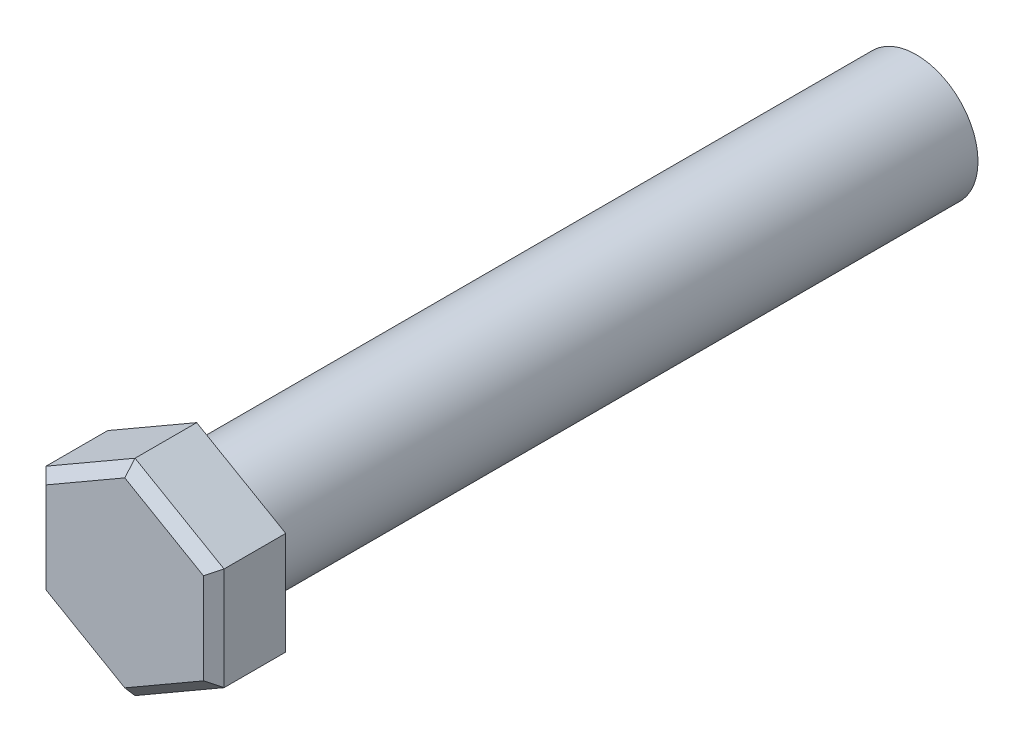
ISO-10303-21;
HEADER;
FILE_DESCRIPTION(('STEP AP214'),'2;1');
FILE_NAME('part.step','',(''),(''),'','','');
FILE_SCHEMA(('AUTOMOTIVE_DESIGN { 1 0 10303 214 1 1 1 1 }'));
ENDSEC;
DATA;
#1=APPLICATION_CONTEXT('core data for automotive mechanical design processes');
#2=APPLICATION_PROTOCOL_DEFINITION('international standard','automotive_design',2000,#1);
#3=PRODUCT_CONTEXT('',#1,'mechanical');
#4=PRODUCT('Part','Part','',(#3));
#5=PRODUCT_RELATED_PRODUCT_CATEGORY('part','',(#4));
#6=PRODUCT_DEFINITION_FORMATION('','',#4);
#7=PRODUCT_DEFINITION_CONTEXT('part definition',#1,'design');
#8=PRODUCT_DEFINITION('design','',#6,#7);
#9=PRODUCT_DEFINITION_SHAPE('','',#8);
#10=(LENGTH_UNIT() NAMED_UNIT(*) SI_UNIT(.MILLI.,.METRE.));
#11=(NAMED_UNIT(*) PLANE_ANGLE_UNIT() SI_UNIT($,.RADIAN.));
#12=(NAMED_UNIT(*) SI_UNIT($,.STERADIAN.) SOLID_ANGLE_UNIT());
#13=UNCERTAINTY_MEASURE_WITH_UNIT(LENGTH_MEASURE(1.E-05),#10,'distance_accuracy_value','');
#14=(GEOMETRIC_REPRESENTATION_CONTEXT(3) GLOBAL_UNCERTAINTY_ASSIGNED_CONTEXT((#13)) GLOBAL_UNIT_ASSIGNED_CONTEXT((#10,
#11,#12)) REPRESENTATION_CONTEXT('',''));
#15=CARTESIAN_POINT('',(0.,0.,0.));
#16=DIRECTION('',(0.,0.,1.));
#17=DIRECTION('',(1.,0.,0.));
#18=AXIS2_PLACEMENT_3D('',#15,#16,#17);
#19=CARTESIAN_POINT('',(0.,0.,70.));
#20=DIRECTION('',(0.,0.,-1.));
#21=DIRECTION('',(-1.,0.,0.));
#22=AXIS2_PLACEMENT_3D('',#19,#20,#21);
#23=CYLINDRICAL_SURFACE('',#22,6.);
#24=CARTESIAN_POINT('',(0.,0.,69.));
#25=DIRECTION('',(0.,0.,1.));
#26=DIRECTION('',(1.,0.,0.));
#27=AXIS2_PLACEMENT_3D('',#24,#25,#26);
#28=CIRCLE('',#27,6.);
#29=CARTESIAN_POINT('',(6.,0.,69.));
#30=VERTEX_POINT('',#29);
#31=EDGE_CURVE('E11',#30,#30,#28,.F.);
#32=ORIENTED_EDGE('',*,*,#31,.T.);
#33=EDGE_LOOP('',(#32));
#34=FACE_BOUND('',#33,.T.);
#35=CARTESIAN_POINT('',(0.,0.,0.));
#36=DIRECTION('',(0.,0.,1.));
#37=DIRECTION('',(1.,0.,0.));
#38=AXIS2_PLACEMENT_3D('',#35,#36,#37);
#39=CIRCLE('',#38,6.);
#40=CARTESIAN_POINT('',(6.,0.,0.));
#41=VERTEX_POINT('',#40);
#42=EDGE_CURVE('E121',#41,#41,#39,.T.);
#43=ORIENTED_EDGE('',*,*,#42,.T.);
#44=EDGE_LOOP('',(#43));
#45=FACE_BOUND('',#44,.T.);
#46=ADVANCED_FACE('F38',(#34,#45),#23,.T.);
#47=CARTESIAN_POINT('',(0.,0.,0.));
#48=DIRECTION('',(0.,0.,1.));
#49=DIRECTION('',(1.,0.,0.));
#50=AXIS2_PLACEMENT_3D('',#47,#48,#49);
#51=PLANE('',#50);
#52=ORIENTED_EDGE('',*,*,#42,.F.);
#53=EDGE_LOOP('',(#52));
#54=FACE_BOUND('',#53,.T.);
#55=ADVANCED_FACE('F210',(#54),#51,.F.);
#56=CARTESIAN_POINT('',(8.66025403784437,0.,77.));
#57=DIRECTION('',(-1.,0.,0.));
#58=DIRECTION('',(0.,-1.,0.));
#59=AXIS2_PLACEMENT_3D('',#56,#57,#58);
#60=PLANE('',#59);
#61=DIRECTION('',(0.,0.,-1.));
#62=VECTOR('',#61,1.);
#63=CARTESIAN_POINT('',(8.66025403784436,5.00000000000004,77.));
#64=LINE('',#63,#62);
#65=CARTESIAN_POINT('',(8.66025403784436,5.00000000000004,76.));
#66=VERTEX_POINT('',#65);
#67=CARTESIAN_POINT('',(8.66025403784436,5.00000000000004,70.));
#68=VERTEX_POINT('',#67);
#69=EDGE_CURVE('E110',#66,#68,#64,.T.);
#70=ORIENTED_EDGE('',*,*,#69,.F.);
#71=DIRECTION('',(0.,-1.,0.));
#72=VECTOR('',#71,1.);
#73=CARTESIAN_POINT('',(8.66025403784438,-5.00000000000001,76.));
#74=LINE('',#73,#72);
#75=CARTESIAN_POINT('',(8.66025403784438,-5.00000000000001,76.));
#76=VERTEX_POINT('',#75);
#77=EDGE_CURVE('E175',#66,#76,#74,.T.);
#78=ORIENTED_EDGE('',*,*,#77,.T.);
#79=DIRECTION('',(0.,0.,-1.));
#80=VECTOR('',#79,1.);
#81=CARTESIAN_POINT('',(8.66025403784438,-5.00000000000001,77.));
#82=LINE('',#81,#80);
#83=CARTESIAN_POINT('',(8.66025403784438,-5.00000000000001,70.));
#84=VERTEX_POINT('',#83);
#85=EDGE_CURVE('E135',#76,#84,#82,.T.);
#86=ORIENTED_EDGE('',*,*,#85,.T.);
#87=DIRECTION('',(0.,1.,0.));
#88=VECTOR('',#87,1.);
#89=CARTESIAN_POINT('',(8.66025403784437,0.,70.));
#90=LINE('',#89,#88);
#91=EDGE_CURVE('E128',#84,#68,#90,.T.);
#92=ORIENTED_EDGE('',*,*,#91,.T.);
#93=EDGE_LOOP('',(#70,#78,#86,#92));
#94=FACE_BOUND('',#93,.T.);
#95=ADVANCED_FACE('F133',(#94),#60,.F.);
#96=CARTESIAN_POINT('',(4.33012701892218,7.50000000000002,77.));
#97=DIRECTION('',(-0.499999999999998,-0.86602540378444,0.));
#98=DIRECTION('',(0.86602540378444,-0.499999999999998,0.));
#99=AXIS2_PLACEMENT_3D('',#96,#97,#98);
#100=PLANE('',#99);
#101=DIRECTION('',(0.,0.,-1.));
#102=VECTOR('',#101,1.);
#103=CARTESIAN_POINT('',(0.,10.,77.));
#104=LINE('',#103,#102);
#105=CARTESIAN_POINT('',(0.,10.,76.));
#106=VERTEX_POINT('',#105);
#107=CARTESIAN_POINT('',(0.,10.,70.));
#108=VERTEX_POINT('',#107);
#109=EDGE_CURVE('E122',#106,#108,#104,.T.);
#110=ORIENTED_EDGE('',*,*,#109,.F.);
#111=DIRECTION('',(0.86602540378444,-0.499999999999998,0.));
#112=VECTOR('',#111,1.);
#113=CARTESIAN_POINT('',(8.66025403784436,5.00000000000004,76.));
#114=LINE('',#113,#112);
#115=EDGE_CURVE('E116',#106,#66,#114,.T.);
#116=ORIENTED_EDGE('',*,*,#115,.T.);
#117=ORIENTED_EDGE('',*,*,#69,.T.);
#118=DIRECTION('',(-0.86602540378444,0.499999999999998,0.));
#119=VECTOR('',#118,1.);
#120=CARTESIAN_POINT('',(4.33012701892218,7.50000000000002,70.));
#121=LINE('',#120,#119);
#122=EDGE_CURVE('E113',#68,#108,#121,.T.);
#123=ORIENTED_EDGE('',*,*,#122,.T.);
#124=EDGE_LOOP('',(#110,#116,#117,#123));
#125=FACE_BOUND('',#124,.T.);
#126=ADVANCED_FACE('F112',(#125),#100,.F.);
#127=CARTESIAN_POINT('',(-4.33012701892218,7.50000000000002,77.));
#128=DIRECTION('',(0.499999999999998,-0.86602540378444,0.));
#129=DIRECTION('',(0.86602540378444,0.499999999999998,0.));
#130=AXIS2_PLACEMENT_3D('',#127,#128,#129);
#131=PLANE('',#130);
#132=DIRECTION('',(0.,0.,-1.));
#133=VECTOR('',#132,1.);
#134=CARTESIAN_POINT('',(-8.66025403784437,5.00000000000004,77.));
#135=LINE('',#134,#133);
#136=CARTESIAN_POINT('',(-8.66025403784437,5.00000000000004,76.));
#137=VERTEX_POINT('',#136);
#138=CARTESIAN_POINT('',(-8.66025403784437,5.00000000000004,70.));
#139=VERTEX_POINT('',#138);
#140=EDGE_CURVE('E157',#137,#139,#135,.T.);
#141=ORIENTED_EDGE('',*,*,#140,.F.);
#142=DIRECTION('',(0.86602540378444,0.499999999999998,0.));
#143=VECTOR('',#142,1.);
#144=CARTESIAN_POINT('',(0.,10.,76.));
#145=LINE('',#144,#143);
#146=EDGE_CURVE('E53',#137,#106,#145,.T.);
#147=ORIENTED_EDGE('',*,*,#146,.T.);
#148=ORIENTED_EDGE('',*,*,#109,.T.);
#149=DIRECTION('',(-0.86602540378444,-0.499999999999998,0.));
#150=VECTOR('',#149,1.);
#151=CARTESIAN_POINT('',(-4.33012701892218,7.50000000000002,70.));
#152=LINE('',#151,#150);
#153=EDGE_CURVE('E131',#108,#139,#152,.T.);
#154=ORIENTED_EDGE('',*,*,#153,.T.);
#155=EDGE_LOOP('',(#141,#147,#148,#154));
#156=FACE_BOUND('',#155,.T.);
#157=ADVANCED_FACE('F279',(#156),#131,.F.);
#158=CARTESIAN_POINT('',(-8.66025403784436,0.,77.));
#159=DIRECTION('',(1.,0.,0.));
#160=DIRECTION('',(0.,1.,0.));
#161=AXIS2_PLACEMENT_3D('',#158,#159,#160);
#162=PLANE('',#161);
#163=DIRECTION('',(0.,0.,-1.));
#164=VECTOR('',#163,1.);
#165=CARTESIAN_POINT('',(-8.66025403784436,-5.00000000000004,77.));
#166=LINE('',#165,#164);
#167=CARTESIAN_POINT('',(-8.66025403784436,-5.00000000000004,76.));
#168=VERTEX_POINT('',#167);
#169=CARTESIAN_POINT('',(-8.66025403784436,-5.00000000000004,70.));
#170=VERTEX_POINT('',#169);
#171=EDGE_CURVE('E155',#168,#170,#166,.T.);
#172=ORIENTED_EDGE('',*,*,#171,.F.);
#173=DIRECTION('',(0.,1.,0.));
#174=VECTOR('',#173,1.);
#175=CARTESIAN_POINT('',(-8.66025403784437,5.00000000000004,76.));
#176=LINE('',#175,#174);
#177=EDGE_CURVE('E61',#168,#137,#176,.T.);
#178=ORIENTED_EDGE('',*,*,#177,.T.);
#179=ORIENTED_EDGE('',*,*,#140,.T.);
#180=DIRECTION('',(0.,-1.,0.));
#181=VECTOR('',#180,1.);
#182=CARTESIAN_POINT('',(-8.66025403784436,0.,70.));
#183=LINE('',#182,#181);
#184=EDGE_CURVE('E144',#139,#170,#183,.T.);
#185=ORIENTED_EDGE('',*,*,#184,.T.);
#186=EDGE_LOOP('',(#172,#178,#179,#185));
#187=FACE_BOUND('',#186,.T.);
#188=ADVANCED_FACE('F278',(#187),#162,.F.);
#189=CARTESIAN_POINT('',(-4.33012701892218,-7.50000000000002,77.));
#190=DIRECTION('',(0.499999999999998,0.86602540378444,0.));
#191=DIRECTION('',(-0.86602540378444,0.499999999999998,0.));
#192=AXIS2_PLACEMENT_3D('',#189,#190,#191);
#193=PLANE('',#192);
#194=DIRECTION('',(0.,0.,-1.));
#195=VECTOR('',#194,1.);
#196=CARTESIAN_POINT('',(0.,-10.,77.));
#197=LINE('',#196,#195);
#198=CARTESIAN_POINT('',(0.,-10.,76.));
#199=VERTEX_POINT('',#198);
#200=CARTESIAN_POINT('',(0.,-10.,70.));
#201=VERTEX_POINT('',#200);
#202=EDGE_CURVE('E153',#199,#201,#197,.T.);
#203=ORIENTED_EDGE('',*,*,#202,.F.);
#204=DIRECTION('',(-0.86602540378444,0.499999999999998,0.));
#205=VECTOR('',#204,1.);
#206=CARTESIAN_POINT('',(-8.66025403784436,-5.00000000000004,76.));
#207=LINE('',#206,#205);
#208=EDGE_CURVE('E179',#199,#168,#207,.T.);
#209=ORIENTED_EDGE('',*,*,#208,.T.);
#210=ORIENTED_EDGE('',*,*,#171,.T.);
#211=DIRECTION('',(0.86602540378444,-0.499999999999998,0.));
#212=VECTOR('',#211,1.);
#213=CARTESIAN_POINT('',(-4.33012701892218,-7.50000000000002,70.));
#214=LINE('',#213,#212);
#215=EDGE_CURVE('E147',#170,#201,#214,.T.);
#216=ORIENTED_EDGE('',*,*,#215,.T.);
#217=EDGE_LOOP('',(#203,#209,#210,#216));
#218=FACE_BOUND('',#217,.T.);
#219=ADVANCED_FACE('F276',(#218),#193,.F.);
#220=CARTESIAN_POINT('',(4.33012701892219,-7.50000000000001,77.));
#221=DIRECTION('',(-0.5,0.866025403784439,0.));
#222=DIRECTION('',(-0.866025403784439,-0.5,0.));
#223=AXIS2_PLACEMENT_3D('',#220,#221,#222);
#224=PLANE('',#223);
#225=ORIENTED_EDGE('',*,*,#85,.F.);
#226=DIRECTION('',(-0.866025403784439,-0.5,0.));
#227=VECTOR('',#226,1.);
#228=CARTESIAN_POINT('',(0.,-10.,76.));
#229=LINE('',#228,#227);
#230=EDGE_CURVE('E177',#76,#199,#229,.T.);
#231=ORIENTED_EDGE('',*,*,#230,.T.);
#232=ORIENTED_EDGE('',*,*,#202,.T.);
#233=DIRECTION('',(0.866025403784439,0.5,0.));
#234=VECTOR('',#233,1.);
#235=CARTESIAN_POINT('',(4.33012701892219,-7.50000000000001,70.));
#236=LINE('',#235,#234);
#237=EDGE_CURVE('E150',#201,#84,#236,.T.);
#238=ORIENTED_EDGE('',*,*,#237,.T.);
#239=EDGE_LOOP('',(#225,#231,#232,#238));
#240=FACE_BOUND('',#239,.T.);
#241=ADVANCED_FACE('F272',(#240),#224,.F.);
#242=CARTESIAN_POINT('',(0.,0.,77.));
#243=DIRECTION('',(0.,0.,1.));
#244=DIRECTION('',(1.,0.,0.));
#245=AXIS2_PLACEMENT_3D('',#242,#243,#244);
#246=PLANE('',#245);
#247=DIRECTION('',(0.866025403784439,0.5,0.));
#248=VECTOR('',#247,1.);
#249=CARTESIAN_POINT('',(8.16025403784437,-4.13397459621556,77.));
#250=LINE('',#249,#248);
#251=CARTESIAN_POINT('',(0.,-8.84529946162074,77.));
#252=VERTEX_POINT('',#251);
#253=CARTESIAN_POINT('',(7.66025403784437,-4.42264973081038,77.));
#254=VERTEX_POINT('',#253);
#255=EDGE_CURVE('E170',#252,#254,#250,.T.);
#256=ORIENTED_EDGE('',*,*,#255,.T.);
#257=DIRECTION('',(0.,1.,0.));
#258=VECTOR('',#257,1.);
#259=CARTESIAN_POINT('',(7.66025403784435,5.00000000000004,77.));
#260=LINE('',#259,#258);
#261=CARTESIAN_POINT('',(7.66025403784435,4.42264973081041,77.));
#262=VERTEX_POINT('',#261);
#263=EDGE_CURVE('E172',#254,#262,#260,.T.);
#264=ORIENTED_EDGE('',*,*,#263,.T.);
#265=DIRECTION('',(-0.86602540378444,0.499999999999998,0.));
#266=VECTOR('',#265,1.);
#267=CARTESIAN_POINT('',(-0.500000000000004,9.13397459621555,77.));
#268=LINE('',#267,#266);
#269=CARTESIAN_POINT('',(0.,8.84529946162074,77.));
#270=VERTEX_POINT('',#269);
#271=EDGE_CURVE('E162',#262,#270,#268,.T.);
#272=ORIENTED_EDGE('',*,*,#271,.T.);
#273=DIRECTION('',(-0.86602540378444,-0.499999999999998,0.));
#274=VECTOR('',#273,1.);
#275=CARTESIAN_POINT('',(-8.16025403784436,4.13397459621559,77.));
#276=LINE('',#275,#274);
#277=CARTESIAN_POINT('',(-7.66025403784435,4.42264973081041,77.));
#278=VERTEX_POINT('',#277);
#279=EDGE_CURVE('E164',#270,#278,#276,.T.);
#280=ORIENTED_EDGE('',*,*,#279,.T.);
#281=DIRECTION('',(0.,-1.,0.));
#282=VECTOR('',#281,1.);
#283=CARTESIAN_POINT('',(-7.66025403784435,-5.00000000000004,77.));
#284=LINE('',#283,#282);
#285=CARTESIAN_POINT('',(-7.66025403784435,-4.4226497308104,77.));
#286=VERTEX_POINT('',#285);
#287=EDGE_CURVE('E166',#278,#286,#284,.T.);
#288=ORIENTED_EDGE('',*,*,#287,.T.);
#289=DIRECTION('',(0.86602540378444,-0.499999999999998,0.));
#290=VECTOR('',#289,1.);
#291=CARTESIAN_POINT('',(0.500000000000004,-9.13397459621555,77.));
#292=LINE('',#291,#290);
#293=EDGE_CURVE('E168',#286,#252,#292,.T.);
#294=ORIENTED_EDGE('',*,*,#293,.T.);
#295=EDGE_LOOP('',(#256,#264,#272,#280,#288,#294));
#296=FACE_BOUND('',#295,.T.);
#297=ADVANCED_FACE('F259',(#296),#246,.T.);
#298=CARTESIAN_POINT('',(0.,0.,70.));
#299=DIRECTION('',(0.,0.,1.));
#300=DIRECTION('',(1.,0.,0.));
#301=AXIS2_PLACEMENT_3D('',#298,#299,#300);
#302=PLANE('',#301);
#303=CARTESIAN_POINT('',(0.,0.,70.));
#304=DIRECTION('',(0.,0.,1.));
#305=DIRECTION('',(1.,0.,0.));
#306=AXIS2_PLACEMENT_3D('',#303,#304,#305);
#307=CIRCLE('',#306,7.);
#308=CARTESIAN_POINT('',(7.,0.,70.));
#309=VERTEX_POINT('',#308);
#310=EDGE_CURVE('E46',#309,#309,#307,.T.);
#311=ORIENTED_EDGE('',*,*,#310,.T.);
#312=EDGE_LOOP('',(#311));
#313=FACE_BOUND('',#312,.T.);
#314=ORIENTED_EDGE('',*,*,#91,.F.);
#315=ORIENTED_EDGE('',*,*,#237,.F.);
#316=ORIENTED_EDGE('',*,*,#215,.F.);
#317=ORIENTED_EDGE('',*,*,#184,.F.);
#318=ORIENTED_EDGE('',*,*,#153,.F.);
#319=ORIENTED_EDGE('',*,*,#122,.F.);
#320=EDGE_LOOP('',(#314,#315,#316,#317,#318,#319));
#321=FACE_BOUND('',#320,.T.);
#322=ADVANCED_FACE('F126',(#313,#321),#302,.F.);
#323=CARTESIAN_POINT('',(-7.66025403784435,0.,77.));
#324=DIRECTION('',(-0.707106781186554,0.,0.707106781186541));
#325=DIRECTION('',(0.,1.,0.));
#326=AXIS2_PLACEMENT_3D('',#323,#324,#325);
#327=PLANE('',#326);
#328=DIRECTION('',(0.654653670707972,-0.377964473009226,0.654653670707983));
#329=VECTOR('',#328,1.);
#330=CARTESIAN_POINT('',(-6.56593203243803,3.79084262640894,78.0943220054064));
#331=LINE('',#330,#329);
#332=EDGE_CURVE('E140',#137,#278,#331,.T.);
#333=ORIENTED_EDGE('',*,*,#332,.F.);
#334=ORIENTED_EDGE('',*,*,#177,.F.);
#335=DIRECTION('',(0.654653670707972,0.377964473009225,0.654653670707984));
#336=VECTOR('',#335,1.);
#337=CARTESIAN_POINT('',(-6.56593203243802,-3.79084262640893,78.0943220054064));
#338=LINE('',#337,#336);
#339=EDGE_CURVE('E137',#286,#168,#338,.F.);
#340=ORIENTED_EDGE('',*,*,#339,.F.);
#341=ORIENTED_EDGE('',*,*,#287,.F.);
#342=EDGE_LOOP('',(#333,#334,#340,#341));
#343=FACE_BOUND('',#342,.T.);
#344=ADVANCED_FACE('F250',(#343),#327,.T.);
#345=CARTESIAN_POINT('',(-3.83012701892218,-6.63397459621557,77.));
#346=DIRECTION('',(-0.353553390593276,-0.612372435695801,0.707106781186541));
#347=DIRECTION('',(-0.86602540378444,0.499999999999998,0.));
#348=AXIS2_PLACEMENT_3D('',#345,#346,#347);
#349=PLANE('',#348);
#350=ORIENTED_EDGE('',*,*,#339,.T.);
#351=ORIENTED_EDGE('',*,*,#208,.F.);
#352=DIRECTION('',(0.,0.755928946018449,0.654653670707984));
#353=VECTOR('',#352,1.);
#354=CARTESIAN_POINT('',(0.,-7.5816852528178,78.0943220054064));
#355=LINE('',#354,#353);
#356=EDGE_CURVE('E191',#252,#199,#355,.F.);
#357=ORIENTED_EDGE('',*,*,#356,.F.);
#358=ORIENTED_EDGE('',*,*,#293,.F.);
#359=EDGE_LOOP('',(#350,#351,#357,#358));
#360=FACE_BOUND('',#359,.T.);
#361=ADVANCED_FACE('F244',(#360),#349,.T.);
#362=CARTESIAN_POINT('',(-3.83012701892218,6.63397459621557,77.));
#363=DIRECTION('',(-0.353553390593275,0.6123724356958,0.707106781186542));
#364=DIRECTION('',(0.86602540378444,0.499999999999998,0.));
#365=AXIS2_PLACEMENT_3D('',#362,#363,#364);
#366=PLANE('',#365);
#367=ORIENTED_EDGE('',*,*,#332,.T.);
#368=ORIENTED_EDGE('',*,*,#279,.F.);
#369=DIRECTION('',(0.,-0.755928946018449,0.654653670707984));
#370=VECTOR('',#369,1.);
#371=CARTESIAN_POINT('',(0.,7.58168525281781,78.0943220054064));
#372=LINE('',#371,#370);
#373=EDGE_CURVE('E188',#106,#270,#372,.T.);
#374=ORIENTED_EDGE('',*,*,#373,.F.);
#375=ORIENTED_EDGE('',*,*,#146,.F.);
#376=EDGE_LOOP('',(#367,#368,#374,#375));
#377=FACE_BOUND('',#376,.T.);
#378=ADVANCED_FACE('F237',(#377),#366,.T.);
#379=CARTESIAN_POINT('',(3.83012701892219,-6.63397459621556,77.));
#380=DIRECTION('',(0.353553390593277,-0.6123724356958,0.707106781186541));
#381=DIRECTION('',(-0.866025403784439,-0.5,0.));
#382=AXIS2_PLACEMENT_3D('',#379,#380,#381);
#383=PLANE('',#382);
#384=ORIENTED_EDGE('',*,*,#356,.T.);
#385=ORIENTED_EDGE('',*,*,#230,.F.);
#386=DIRECTION('',(-0.654653670707973,0.377964473009224,0.654653670707983));
#387=VECTOR('',#386,1.);
#388=CARTESIAN_POINT('',(6.56593203243804,-3.79084262640891,78.0943220054064));
#389=LINE('',#388,#387);
#390=EDGE_CURVE('E186',#254,#76,#389,.F.);
#391=ORIENTED_EDGE('',*,*,#390,.F.);
#392=ORIENTED_EDGE('',*,*,#255,.F.);
#393=EDGE_LOOP('',(#384,#385,#391,#392));
#394=FACE_BOUND('',#393,.T.);
#395=ADVANCED_FACE('F230',(#394),#383,.T.);
#396=CARTESIAN_POINT('',(3.83012701892218,6.63397459621557,77.));
#397=DIRECTION('',(0.353553390593276,0.612372435695801,0.707106781186541));
#398=DIRECTION('',(0.86602540378444,-0.499999999999998,0.));
#399=AXIS2_PLACEMENT_3D('',#396,#397,#398);
#400=PLANE('',#399);
#401=ORIENTED_EDGE('',*,*,#373,.T.);
#402=ORIENTED_EDGE('',*,*,#271,.F.);
#403=DIRECTION('',(0.654653670707971,0.377964473009226,-0.654653670707984));
#404=VECTOR('',#403,1.);
#405=CARTESIAN_POINT('',(6.56593203243803,3.79084262640894,78.0943220054064));
#406=LINE('',#405,#404);
#407=EDGE_CURVE('E184',#66,#262,#406,.F.);
#408=ORIENTED_EDGE('',*,*,#407,.F.);
#409=ORIENTED_EDGE('',*,*,#115,.F.);
#410=EDGE_LOOP('',(#401,#402,#408,#409));
#411=FACE_BOUND('',#410,.T.);
#412=ADVANCED_FACE('F205',(#411),#400,.T.);
#413=CARTESIAN_POINT('',(7.66025403784436,0.,77.));
#414=DIRECTION('',(0.707106781186554,0.,0.707106781186541));
#415=DIRECTION('',(0.,-1.,0.));
#416=AXIS2_PLACEMENT_3D('',#413,#414,#415);
#417=PLANE('',#416);
#418=ORIENTED_EDGE('',*,*,#390,.T.);
#419=ORIENTED_EDGE('',*,*,#77,.F.);
#420=ORIENTED_EDGE('',*,*,#407,.T.);
#421=ORIENTED_EDGE('',*,*,#263,.F.);
#422=EDGE_LOOP('',(#418,#419,#420,#421));
#423=FACE_BOUND('',#422,.T.);
#424=ADVANCED_FACE('F200',(#423),#417,.T.);
#425=CARTESIAN_POINT('',(0.,0.,69.));
#426=DIRECTION('',(0.,0.,1.));
#427=DIRECTION('',(1.,0.,0.));
#428=AXIS2_PLACEMENT_3D('',#425,#426,#427);
#429=TOROIDAL_SURFACE('',#428,7.,1.);
#430=ORIENTED_EDGE('',*,*,#31,.F.);
#431=EDGE_LOOP('',(#430));
#432=FACE_BOUND('',#431,.T.);
#433=ORIENTED_EDGE('',*,*,#310,.F.);
#434=EDGE_LOOP('',(#433));
#435=FACE_BOUND('',#434,.T.);
#436=ADVANCED_FACE('F40',(#432,#435),#429,.F.);
#437=CLOSED_SHELL('',(#46,#55,#95,#126,#157,#188,#219,#241,#297,#322,#344,#361,#378,#395,#412,
#424,#436));
#438=MANIFOLD_SOLID_BREP('B2',#437);
#439=ADVANCED_BREP_SHAPE_REPRESENTATION('',(#18,#438),#14);
#440=SHAPE_DEFINITION_REPRESENTATION(#9,#439);
ENDSEC;
END-ISO-10303-21;
